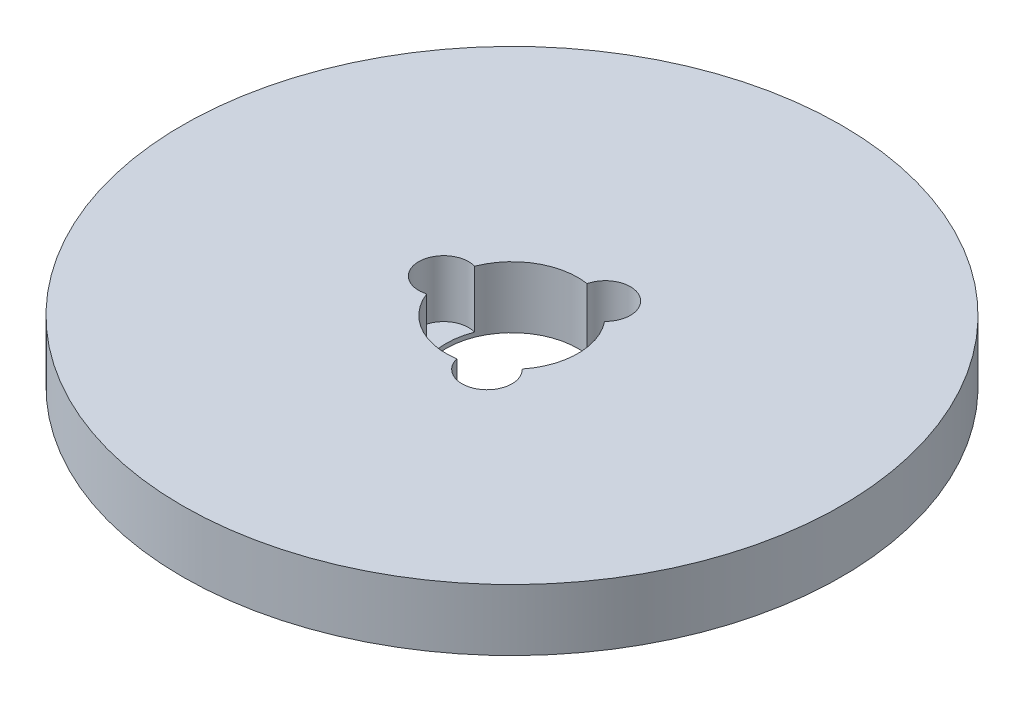
ISO-10303-21;
HEADER;
FILE_DESCRIPTION(('STEP AP214'),'2;1');
FILE_NAME('part.step','',(''),(''),'','','');
FILE_SCHEMA(('AUTOMOTIVE_DESIGN { 1 0 10303 214 1 1 1 1 }'));
ENDSEC;
DATA;
#1=APPLICATION_CONTEXT('core data for automotive mechanical design processes');
#2=APPLICATION_PROTOCOL_DEFINITION('international standard','automotive_design',2000,#1);
#3=PRODUCT_CONTEXT('',#1,'mechanical');
#4=PRODUCT('Part','Part','',(#3));
#5=PRODUCT_RELATED_PRODUCT_CATEGORY('part','',(#4));
#6=PRODUCT_DEFINITION_FORMATION('','',#4);
#7=PRODUCT_DEFINITION_CONTEXT('part definition',#1,'design');
#8=PRODUCT_DEFINITION('design','',#6,#7);
#9=PRODUCT_DEFINITION_SHAPE('','',#8);
#10=(LENGTH_UNIT() NAMED_UNIT(*) SI_UNIT(.MILLI.,.METRE.));
#11=(NAMED_UNIT(*) PLANE_ANGLE_UNIT() SI_UNIT($,.RADIAN.));
#12=(NAMED_UNIT(*) SI_UNIT($,.STERADIAN.) SOLID_ANGLE_UNIT());
#13=UNCERTAINTY_MEASURE_WITH_UNIT(LENGTH_MEASURE(1.E-05),#10,'distance_accuracy_value','');
#14=(GEOMETRIC_REPRESENTATION_CONTEXT(3) GLOBAL_UNCERTAINTY_ASSIGNED_CONTEXT((#13)) GLOBAL_UNIT_ASSIGNED_CONTEXT((#10,
#11,#12)) REPRESENTATION_CONTEXT('',''));
#15=CARTESIAN_POINT('',(0.,0.,0.));
#16=DIRECTION('',(0.,0.,1.));
#17=DIRECTION('',(1.,0.,0.));
#18=AXIS2_PLACEMENT_3D('',#15,#16,#17);
#19=CARTESIAN_POINT('',(0.,14.,0.));
#20=DIRECTION('',(0.,-1.,0.));
#21=DIRECTION('',(0.,0.,-1.));
#22=AXIS2_PLACEMENT_3D('',#19,#20,#21);
#23=CYLINDRICAL_SURFACE('',#22,75.);
#24=CARTESIAN_POINT('',(0.,14.,0.));
#25=DIRECTION('',(0.,1.,0.));
#26=DIRECTION('',(0.,0.,1.));
#27=AXIS2_PLACEMENT_3D('',#24,#25,#26);
#28=CIRCLE('',#27,75.);
#29=CARTESIAN_POINT('',(0.,14.,75.));
#30=VERTEX_POINT('',#29);
#31=EDGE_CURVE('E126',#30,#30,#28,.T.);
#32=ORIENTED_EDGE('',*,*,#31,.F.);
#33=EDGE_LOOP('',(#32));
#34=FACE_BOUND('',#33,.T.);
#35=CARTESIAN_POINT('',(0.,0.,0.));
#36=DIRECTION('',(0.,1.,0.));
#37=DIRECTION('',(0.,0.,1.));
#38=AXIS2_PLACEMENT_3D('',#35,#36,#37);
#39=CIRCLE('',#38,75.);
#40=CARTESIAN_POINT('',(0.,0.,75.));
#41=VERTEX_POINT('',#40);
#42=EDGE_CURVE('E124',#41,#41,#39,.T.);
#43=ORIENTED_EDGE('',*,*,#42,.T.);
#44=EDGE_LOOP('',(#43));
#45=FACE_BOUND('',#44,.T.);
#46=ADVANCED_FACE('F39',(#34,#45),#23,.T.);
#47=CARTESIAN_POINT('',(0.,14.,0.));
#48=DIRECTION('',(0.,1.,0.));
#49=DIRECTION('',(0.,0.,1.));
#50=AXIS2_PLACEMENT_3D('',#47,#48,#49);
#51=PLANE('',#50);
#52=CARTESIAN_POINT('',(7.77589368477686,14.,13.4682429362873));
#53=DIRECTION('',(0.,1.,0.));
#54=DIRECTION('',(0.866025403784436,0.,-0.500000000000004));
#55=AXIS2_PLACEMENT_3D('',#52,#53,#54);
#56=CIRCLE('',#55,5.68283118755813);
#57=CARTESIAN_POINT('',(2.25838791965767,14.,14.8290149370868));
#58=VERTEX_POINT('',#57);
#59=CARTESIAN_POINT('',(11.7131096887873,14.,9.37032877856674));
#60=VERTEX_POINT('',#59);
#61=EDGE_CURVE('E147',#58,#60,#56,.T.);
#62=ORIENTED_EDGE('',*,*,#61,.F.);
#63=CARTESIAN_POINT('',(0.,14.,0.));
#64=DIRECTION('',(0.,1.,0.));
#65=DIRECTION('',(0.,0.,1.));
#66=AXIS2_PLACEMENT_3D('',#63,#64,#65);
#67=CIRCLE('',#66,15.);
#68=CARTESIAN_POINT('',(-13.9714976084449,14.,5.45868615852005));
#69=VERTEX_POINT('',#68);
#70=EDGE_CURVE('E118',#69,#58,#67,.T.);
#71=ORIENTED_EDGE('',*,*,#70,.F.);
#72=CARTESIAN_POINT('',(-15.5517873695536,14.,0.));
#73=DIRECTION('',(0.,1.,0.));
#74=DIRECTION('',(0.,0.,1.));
#75=AXIS2_PLACEMENT_3D('',#72,#73,#74);
#76=CIRCLE('',#75,5.68283118755813);
#77=CARTESIAN_POINT('',(-13.9714976084449,14.,-5.45868615852005));
#78=VERTEX_POINT('',#77);
#79=EDGE_CURVE('E113',#78,#69,#76,.T.);
#80=ORIENTED_EDGE('',*,*,#79,.F.);
#81=CARTESIAN_POINT('',(2.25838791965746,14.,-14.8290149370869));
#82=VERTEX_POINT('',#81);
#83=EDGE_CURVE('E106',#82,#78,#67,.T.);
#84=ORIENTED_EDGE('',*,*,#83,.F.);
#85=CARTESIAN_POINT('',(7.77589368477667,14.,-13.4682429362875));
#86=DIRECTION('',(0.,1.,0.));
#87=DIRECTION('',(-0.866025403784443,0.,-0.499999999999992));
#88=AXIS2_PLACEMENT_3D('',#85,#86,#87);
#89=CIRCLE('',#88,5.68283118755813);
#90=CARTESIAN_POINT('',(11.7131096887872,14.,-9.3703287785669));
#91=VERTEX_POINT('',#90);
#92=EDGE_CURVE('E90',#91,#82,#89,.T.);
#93=ORIENTED_EDGE('',*,*,#92,.F.);
#94=EDGE_CURVE('E116',#60,#91,#67,.T.);
#95=ORIENTED_EDGE('',*,*,#94,.F.);
#96=EDGE_LOOP('',(#62,#71,#80,#84,#93,#95));
#97=FACE_BOUND('',#96,.T.);
#98=ORIENTED_EDGE('',*,*,#31,.T.);
#99=EDGE_LOOP('',(#98));
#100=FACE_BOUND('',#99,.T.);
#101=ADVANCED_FACE('F115',(#97,#100),#51,.T.);
#102=CARTESIAN_POINT('',(0.,0.,0.));
#103=DIRECTION('',(0.,1.,0.));
#104=DIRECTION('',(0.,0.,1.));
#105=AXIS2_PLACEMENT_3D('',#102,#103,#104);
#106=PLANE('',#105);
#107=CARTESIAN_POINT('',(0.,0.,0.));
#108=DIRECTION('',(0.,1.,0.));
#109=DIRECTION('',(0.,0.,1.));
#110=AXIS2_PLACEMENT_3D('',#107,#108,#109);
#111=CIRCLE('',#110,15.);
#112=CARTESIAN_POINT('',(0.,0.,15.));
#113=VERTEX_POINT('',#112);
#114=EDGE_CURVE('E120',#113,#113,#111,.T.);
#115=ORIENTED_EDGE('',*,*,#114,.T.);
#116=EDGE_LOOP('',(#115));
#117=FACE_BOUND('',#116,.T.);
#118=ORIENTED_EDGE('',*,*,#42,.F.);
#119=EDGE_LOOP('',(#118));
#120=FACE_BOUND('',#119,.T.);
#121=ADVANCED_FACE('F164',(#117,#120),#106,.F.);
#122=CARTESIAN_POINT('',(0.,14.,0.));
#123=DIRECTION('',(0.,-1.,0.));
#124=DIRECTION('',(0.,0.,-1.));
#125=AXIS2_PLACEMENT_3D('',#122,#123,#124);
#126=CYLINDRICAL_SURFACE('',#125,15.);
#127=DIRECTION('',(0.,1.,0.));
#128=VECTOR('',#127,1.);
#129=CARTESIAN_POINT('',(2.25838791965767,7.50066101601706,14.8290149370868));
#130=LINE('',#129,#128);
#131=CARTESIAN_POINT('',(2.25838791965767,1.00132203203412,14.8290149370868));
#132=VERTEX_POINT('',#131);
#133=EDGE_CURVE('E11',#132,#58,#130,.T.);
#134=ORIENTED_EDGE('',*,*,#133,.F.);
#135=CARTESIAN_POINT('',(0.,1.00132203203412,0.));
#136=DIRECTION('',(0.,1.,0.));
#137=DIRECTION('',(0.,0.,1.));
#138=AXIS2_PLACEMENT_3D('',#135,#136,#137);
#139=CIRCLE('',#138,15.);
#140=CARTESIAN_POINT('',(11.7131096887873,1.00132203203412,9.37032877856674));
#141=VERTEX_POINT('',#140);
#142=EDGE_CURVE('E144',#132,#141,#139,.T.);
#143=ORIENTED_EDGE('',*,*,#142,.T.);
#144=DIRECTION('',(0.,1.,0.));
#145=VECTOR('',#144,1.);
#146=CARTESIAN_POINT('',(11.7131096887873,7.50066101601706,9.37032877856674));
#147=LINE('',#146,#145);
#148=EDGE_CURVE('E46',#60,#141,#147,.F.);
#149=ORIENTED_EDGE('',*,*,#148,.F.);
#150=ORIENTED_EDGE('',*,*,#94,.T.);
#151=DIRECTION('',(0.,1.,0.));
#152=VECTOR('',#151,1.);
#153=CARTESIAN_POINT('',(11.7131096887872,7.50066101601706,-9.3703287785669));
#154=LINE('',#153,#152);
#155=CARTESIAN_POINT('',(11.7131096887872,1.00132203203412,-9.3703287785669));
#156=VERTEX_POINT('',#155);
#157=EDGE_CURVE('E92',#156,#91,#154,.T.);
#158=ORIENTED_EDGE('',*,*,#157,.F.);
#159=CARTESIAN_POINT('',(0.,1.00132203203412,0.));
#160=DIRECTION('',(0.,1.,0.));
#161=DIRECTION('',(0.,0.,1.));
#162=AXIS2_PLACEMENT_3D('',#159,#160,#161);
#163=CIRCLE('',#162,15.);
#164=CARTESIAN_POINT('',(2.25838791965746,1.00132203203412,-14.8290149370869));
#165=VERTEX_POINT('',#164);
#166=EDGE_CURVE('E107',#156,#165,#163,.T.);
#167=ORIENTED_EDGE('',*,*,#166,.T.);
#168=DIRECTION('',(0.,1.,0.));
#169=VECTOR('',#168,1.);
#170=CARTESIAN_POINT('',(2.25838791965746,7.50066101601706,-14.8290149370869));
#171=LINE('',#170,#169);
#172=EDGE_CURVE('E95',#82,#165,#171,.F.);
#173=ORIENTED_EDGE('',*,*,#172,.F.);
#174=ORIENTED_EDGE('',*,*,#83,.T.);
#175=DIRECTION('',(0.,1.,0.));
#176=VECTOR('',#175,1.);
#177=CARTESIAN_POINT('',(-13.9714976084449,7.50066101601706,-5.45868615852005));
#178=LINE('',#177,#176);
#179=CARTESIAN_POINT('',(-13.9714976084449,1.00132203203412,-5.45868615852005));
#180=VERTEX_POINT('',#179);
#181=EDGE_CURVE('E143',#180,#78,#178,.T.);
#182=ORIENTED_EDGE('',*,*,#181,.F.);
#183=CARTESIAN_POINT('',(0.,1.00132203203412,0.));
#184=DIRECTION('',(0.,1.,0.));
#185=DIRECTION('',(0.,0.,1.));
#186=AXIS2_PLACEMENT_3D('',#183,#184,#185);
#187=CIRCLE('',#186,15.);
#188=CARTESIAN_POINT('',(-13.9714976084449,1.00132203203412,5.45868615852005));
#189=VERTEX_POINT('',#188);
#190=EDGE_CURVE('E132',#180,#189,#187,.T.);
#191=ORIENTED_EDGE('',*,*,#190,.T.);
#192=DIRECTION('',(0.,1.,0.));
#193=VECTOR('',#192,1.);
#194=CARTESIAN_POINT('',(-13.9714976084449,7.50066101601706,5.45868615852005));
#195=LINE('',#194,#193);
#196=EDGE_CURVE('E137',#69,#189,#195,.F.);
#197=ORIENTED_EDGE('',*,*,#196,.F.);
#198=ORIENTED_EDGE('',*,*,#70,.T.);
#199=EDGE_LOOP('',(#134,#143,#149,#150,#158,#167,#173,#174,#182,#191,#197,#198));
#200=FACE_BOUND('',#199,.T.);
#201=ORIENTED_EDGE('',*,*,#114,.F.);
#202=EDGE_LOOP('',(#201));
#203=FACE_BOUND('',#202,.T.);
#204=ADVANCED_FACE('F103',(#200,#203),#126,.F.);
#205=CARTESIAN_POINT('',(-15.5517873695536,1.00132203203412,0.));
#206=DIRECTION('',(0.,1.,0.));
#207=DIRECTION('',(0.,0.,1.));
#208=AXIS2_PLACEMENT_3D('',#205,#206,#207);
#209=CYLINDRICAL_SURFACE('',#208,5.68283118755813);
#210=ORIENTED_EDGE('',*,*,#181,.T.);
#211=ORIENTED_EDGE('',*,*,#79,.T.);
#212=ORIENTED_EDGE('',*,*,#196,.T.);
#213=CARTESIAN_POINT('',(-15.5517873695536,1.00132203203412,0.));
#214=DIRECTION('',(0.,1.,0.));
#215=DIRECTION('',(0.,0.,1.));
#216=AXIS2_PLACEMENT_3D('',#213,#214,#215);
#217=CIRCLE('',#216,5.68283118755813);
#218=EDGE_CURVE('E121',#180,#189,#217,.T.);
#219=ORIENTED_EDGE('',*,*,#218,.F.);
#220=EDGE_LOOP('',(#210,#211,#212,#219));
#221=FACE_BOUND('',#220,.T.);
#222=ADVANCED_FACE('F174',(#221),#209,.F.);
#223=CARTESIAN_POINT('',(-15.5517873695536,1.00132203203412,0.));
#224=DIRECTION('',(0.,1.,0.));
#225=DIRECTION('',(0.,0.,1.));
#226=AXIS2_PLACEMENT_3D('',#223,#224,#225);
#227=PLANE('',#226);
#228=ORIENTED_EDGE('',*,*,#218,.T.);
#229=ORIENTED_EDGE('',*,*,#190,.F.);
#230=EDGE_LOOP('',(#228,#229));
#231=FACE_BOUND('',#230,.T.);
#232=ADVANCED_FACE('F177',(#231),#227,.T.);
#233=CARTESIAN_POINT('',(7.77589368477667,1.00132203203412,-13.4682429362875));
#234=DIRECTION('',(0.,1.,0.));
#235=DIRECTION('',(0.,0.,1.));
#236=AXIS2_PLACEMENT_3D('',#233,#234,#235);
#237=CYLINDRICAL_SURFACE('',#236,5.68283118755813);
#238=ORIENTED_EDGE('',*,*,#157,.T.);
#239=ORIENTED_EDGE('',*,*,#92,.T.);
#240=ORIENTED_EDGE('',*,*,#172,.T.);
#241=CARTESIAN_POINT('',(7.77589368477667,1.00132203203412,-13.4682429362875));
#242=DIRECTION('',(0.,1.,0.));
#243=DIRECTION('',(-0.866025403784443,0.,-0.499999999999992));
#244=AXIS2_PLACEMENT_3D('',#241,#242,#243);
#245=CIRCLE('',#244,5.68283118755813);
#246=EDGE_CURVE('E56',#156,#165,#245,.T.);
#247=ORIENTED_EDGE('',*,*,#246,.F.);
#248=EDGE_LOOP('',(#238,#239,#240,#247));
#249=FACE_BOUND('',#248,.T.);
#250=ADVANCED_FACE('F93',(#249),#237,.F.);
#251=CARTESIAN_POINT('',(7.77589368477667,1.00132203203412,-13.4682429362875));
#252=DIRECTION('',(0.,1.,0.));
#253=DIRECTION('',(-0.866025403784443,0.,-0.499999999999992));
#254=AXIS2_PLACEMENT_3D('',#251,#252,#253);
#255=PLANE('',#254);
#256=ORIENTED_EDGE('',*,*,#246,.T.);
#257=ORIENTED_EDGE('',*,*,#166,.F.);
#258=EDGE_LOOP('',(#256,#257));
#259=FACE_BOUND('',#258,.T.);
#260=ADVANCED_FACE('F160',(#259),#255,.T.);
#261=CARTESIAN_POINT('',(7.77589368477686,1.00132203203412,13.4682429362873));
#262=DIRECTION('',(0.,1.,0.));
#263=DIRECTION('',(0.,0.,1.));
#264=AXIS2_PLACEMENT_3D('',#261,#262,#263);
#265=CYLINDRICAL_SURFACE('',#264,5.68283118755813);
#266=ORIENTED_EDGE('',*,*,#133,.T.);
#267=ORIENTED_EDGE('',*,*,#61,.T.);
#268=ORIENTED_EDGE('',*,*,#148,.T.);
#269=CARTESIAN_POINT('',(7.77589368477686,1.00132203203412,13.4682429362873));
#270=DIRECTION('',(0.,1.,0.));
#271=DIRECTION('',(0.866025403784436,0.,-0.500000000000004));
#272=AXIS2_PLACEMENT_3D('',#269,#270,#271);
#273=CIRCLE('',#272,5.68283118755813);
#274=EDGE_CURVE('E55',#132,#141,#273,.T.);
#275=ORIENTED_EDGE('',*,*,#274,.F.);
#276=EDGE_LOOP('',(#266,#267,#268,#275));
#277=FACE_BOUND('',#276,.T.);
#278=ADVANCED_FACE('F149',(#277),#265,.F.);
#279=CARTESIAN_POINT('',(7.77589368477686,1.00132203203412,13.4682429362873));
#280=DIRECTION('',(0.,1.,0.));
#281=DIRECTION('',(0.866025403784436,0.,-0.500000000000004));
#282=AXIS2_PLACEMENT_3D('',#279,#280,#281);
#283=PLANE('',#282);
#284=ORIENTED_EDGE('',*,*,#274,.T.);
#285=ORIENTED_EDGE('',*,*,#142,.F.);
#286=EDGE_LOOP('',(#284,#285));
#287=FACE_BOUND('',#286,.T.);
#288=ADVANCED_FACE('F151',(#287),#283,.T.);
#289=CLOSED_SHELL('',(#46,#101,#121,#204,#222,#232,#250,#260,#278,#288));
#290=MANIFOLD_SOLID_BREP('B2',#289);
#291=ADVANCED_BREP_SHAPE_REPRESENTATION('',(#18,#290),#14);
#292=SHAPE_DEFINITION_REPRESENTATION(#9,#291);
ENDSEC;
END-ISO-10303-21;
